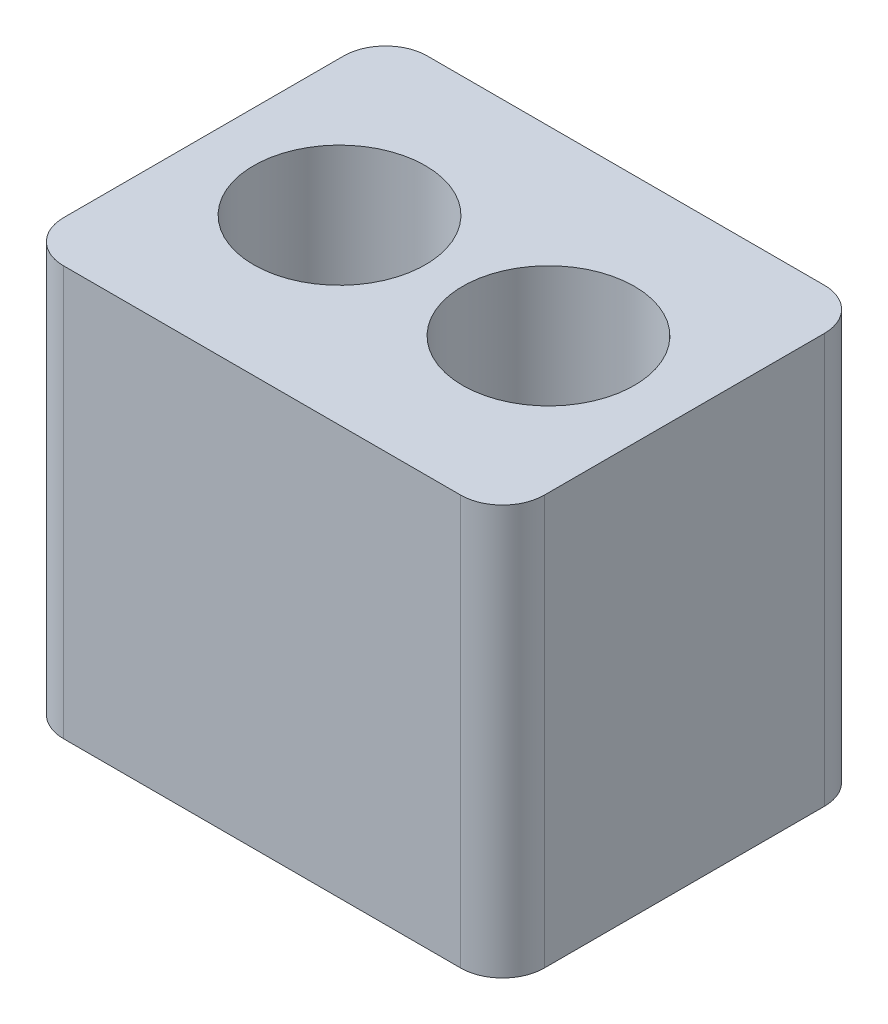
ISO-10303-21;
HEADER;
FILE_DESCRIPTION(('STEP AP214'),'2;1');
FILE_NAME('part.step','',(''),(''),'','','');
FILE_SCHEMA(('AUTOMOTIVE_DESIGN { 1 0 10303 214 1 1 1 1 }'));
ENDSEC;
DATA;
#1=APPLICATION_CONTEXT('core data for automotive mechanical design processes');
#2=APPLICATION_PROTOCOL_DEFINITION('international standard','automotive_design',2000,#1);
#3=PRODUCT_CONTEXT('',#1,'mechanical');
#4=PRODUCT('Part','Part','',(#3));
#5=PRODUCT_RELATED_PRODUCT_CATEGORY('part','',(#4));
#6=PRODUCT_DEFINITION_FORMATION('','',#4);
#7=PRODUCT_DEFINITION_CONTEXT('part definition',#1,'design');
#8=PRODUCT_DEFINITION('design','',#6,#7);
#9=PRODUCT_DEFINITION_SHAPE('','',#8);
#10=(LENGTH_UNIT() NAMED_UNIT(*) SI_UNIT(.MILLI.,.METRE.));
#11=(NAMED_UNIT(*) PLANE_ANGLE_UNIT() SI_UNIT($,.RADIAN.));
#12=(NAMED_UNIT(*) SI_UNIT($,.STERADIAN.) SOLID_ANGLE_UNIT());
#13=UNCERTAINTY_MEASURE_WITH_UNIT(LENGTH_MEASURE(1.E-05),#10,'distance_accuracy_value','');
#14=(GEOMETRIC_REPRESENTATION_CONTEXT(3) GLOBAL_UNCERTAINTY_ASSIGNED_CONTEXT((#13)) GLOBAL_UNIT_ASSIGNED_CONTEXT((#10,
#11,#12)) REPRESENTATION_CONTEXT('',''));
#15=CARTESIAN_POINT('',(0.,0.,0.));
#16=DIRECTION('',(0.,0.,1.));
#17=DIRECTION('',(1.,0.,0.));
#18=AXIS2_PLACEMENT_3D('',#15,#16,#17);
#19=CARTESIAN_POINT('',(2.667,-2.4892,-0.254));
#20=DIRECTION('',(0.,1.,0.));
#21=DIRECTION('',(0.,0.,1.));
#22=AXIS2_PLACEMENT_3D('',#19,#20,#21);
#23=CYLINDRICAL_SURFACE('',#22,0.254);
#24=CARTESIAN_POINT('',(2.667,0.,-0.254));
#25=DIRECTION('',(0.,1.,0.));
#26=DIRECTION('',(0.,0.,1.));
#27=AXIS2_PLACEMENT_3D('',#24,#25,#26);
#28=CIRCLE('',#27,0.254);
#29=CARTESIAN_POINT('',(2.667,0.,0.));
#30=VERTEX_POINT('',#29);
#31=CARTESIAN_POINT('',(2.921,0.,-0.254));
#32=VERTEX_POINT('',#31);
#33=EDGE_CURVE('E113',#30,#32,#28,.T.);
#34=ORIENTED_EDGE('',*,*,#33,.F.);
#35=DIRECTION('',(0.,1.,0.));
#36=VECTOR('',#35,1.);
#37=CARTESIAN_POINT('',(2.667,-2.4892,0.));
#38=LINE('',#37,#36);
#39=CARTESIAN_POINT('',(2.667,-2.4892,0.));
#40=VERTEX_POINT('',#39);
#41=EDGE_CURVE('E11',#40,#30,#38,.T.);
#42=ORIENTED_EDGE('',*,*,#41,.F.);
#43=CARTESIAN_POINT('',(2.667,-2.4892,-0.254));
#44=DIRECTION('',(0.,1.,0.));
#45=DIRECTION('',(0.,0.,1.));
#46=AXIS2_PLACEMENT_3D('',#43,#44,#45);
#47=CIRCLE('',#46,0.254);
#48=CARTESIAN_POINT('',(2.921,-2.4892,-0.254));
#49=VERTEX_POINT('',#48);
#50=EDGE_CURVE('E134',#40,#49,#47,.T.);
#51=ORIENTED_EDGE('',*,*,#50,.T.);
#52=DIRECTION('',(0.,1.,0.));
#53=VECTOR('',#52,1.);
#54=CARTESIAN_POINT('',(2.921,-2.4892,-0.254));
#55=LINE('',#54,#53);
#56=EDGE_CURVE('E19',#49,#32,#55,.T.);
#57=ORIENTED_EDGE('',*,*,#56,.T.);
#58=EDGE_LOOP('',(#34,#42,#51,#57));
#59=FACE_BOUND('',#58,.T.);
#60=ADVANCED_FACE('F16',(#59),#23,.T.);
#61=CARTESIAN_POINT('',(0.254000000000002,-2.4892,0.));
#62=DIRECTION('',(0.,0.,1.));
#63=DIRECTION('',(1.,0.,0.));
#64=AXIS2_PLACEMENT_3D('',#61,#62,#63);
#65=PLANE('',#64);
#66=DIRECTION('',(1.,0.,0.));
#67=VECTOR('',#66,1.);
#68=CARTESIAN_POINT('',(0.254000000000002,0.,0.));
#69=LINE('',#68,#67);
#70=CARTESIAN_POINT('',(0.254000000000002,0.,0.));
#71=VERTEX_POINT('',#70);
#72=EDGE_CURVE('E132',#71,#30,#69,.T.);
#73=ORIENTED_EDGE('',*,*,#72,.F.);
#74=DIRECTION('',(0.,1.,0.));
#75=VECTOR('',#74,1.);
#76=CARTESIAN_POINT('',(0.254000000000002,-2.4892,0.));
#77=LINE('',#76,#75);
#78=CARTESIAN_POINT('',(0.254000000000002,-2.4892,0.));
#79=VERTEX_POINT('',#78);
#80=EDGE_CURVE('E25',#79,#71,#77,.T.);
#81=ORIENTED_EDGE('',*,*,#80,.F.);
#82=DIRECTION('',(1.,0.,0.));
#83=VECTOR('',#82,1.);
#84=CARTESIAN_POINT('',(0.254000000000002,-2.4892,0.));
#85=LINE('',#84,#83);
#86=EDGE_CURVE('E103',#79,#40,#85,.T.);
#87=ORIENTED_EDGE('',*,*,#86,.T.);
#88=ORIENTED_EDGE('',*,*,#41,.T.);
#89=EDGE_LOOP('',(#73,#81,#87,#88));
#90=FACE_BOUND('',#89,.T.);
#91=ADVANCED_FACE('F146',(#90),#65,.T.);
#92=CARTESIAN_POINT('',(0.254,-2.4892,-0.254));
#93=DIRECTION('',(0.,1.,0.));
#94=DIRECTION('',(0.,0.,1.));
#95=AXIS2_PLACEMENT_3D('',#92,#93,#94);
#96=CYLINDRICAL_SURFACE('',#95,0.254);
#97=CARTESIAN_POINT('',(0.254,0.,-0.254));
#98=DIRECTION('',(0.,1.,0.));
#99=DIRECTION('',(0.,0.,-1.));
#100=AXIS2_PLACEMENT_3D('',#97,#98,#99);
#101=CIRCLE('',#100,0.254);
#102=CARTESIAN_POINT('',(0.,0.,-0.254000000000002));
#103=VERTEX_POINT('',#102);
#104=EDGE_CURVE('E90',#103,#71,#101,.T.);
#105=ORIENTED_EDGE('',*,*,#104,.F.);
#106=DIRECTION('',(0.,1.,0.));
#107=VECTOR('',#106,1.);
#108=CARTESIAN_POINT('',(0.,-2.4892,-0.254000000000002));
#109=LINE('',#108,#107);
#110=CARTESIAN_POINT('',(0.,-2.4892,-0.254000000000002));
#111=VERTEX_POINT('',#110);
#112=EDGE_CURVE('E85',#111,#103,#109,.T.);
#113=ORIENTED_EDGE('',*,*,#112,.F.);
#114=CARTESIAN_POINT('',(0.254,-2.4892,-0.254));
#115=DIRECTION('',(0.,1.,0.));
#116=DIRECTION('',(0.,0.,-1.));
#117=AXIS2_PLACEMENT_3D('',#114,#115,#116);
#118=CIRCLE('',#117,0.254);
#119=EDGE_CURVE('E88',#111,#79,#118,.T.);
#120=ORIENTED_EDGE('',*,*,#119,.T.);
#121=ORIENTED_EDGE('',*,*,#80,.T.);
#122=EDGE_LOOP('',(#105,#113,#120,#121));
#123=FACE_BOUND('',#122,.T.);
#124=ADVANCED_FACE('F87',(#123),#96,.T.);
#125=CARTESIAN_POINT('',(0.,-2.4892,-1.9558));
#126=DIRECTION('',(-1.,0.,0.));
#127=DIRECTION('',(0.,0.,1.));
#128=AXIS2_PLACEMENT_3D('',#125,#126,#127);
#129=PLANE('',#128);
#130=DIRECTION('',(0.,0.,1.));
#131=VECTOR('',#130,1.);
#132=CARTESIAN_POINT('',(0.,0.,-1.9558));
#133=LINE('',#132,#131);
#134=CARTESIAN_POINT('',(0.,0.,-1.9558));
#135=VERTEX_POINT('',#134);
#136=EDGE_CURVE('E129',#135,#103,#133,.T.);
#137=ORIENTED_EDGE('',*,*,#136,.F.);
#138=DIRECTION('',(0.,1.,0.));
#139=VECTOR('',#138,1.);
#140=CARTESIAN_POINT('',(0.,-2.4892,-1.9558));
#141=LINE('',#140,#139);
#142=CARTESIAN_POINT('',(0.,-2.4892,-1.9558));
#143=VERTEX_POINT('',#142);
#144=EDGE_CURVE('E95',#143,#135,#141,.T.);
#145=ORIENTED_EDGE('',*,*,#144,.F.);
#146=DIRECTION('',(0.,0.,1.));
#147=VECTOR('',#146,1.);
#148=CARTESIAN_POINT('',(0.,-2.4892,-1.9558));
#149=LINE('',#148,#147);
#150=EDGE_CURVE('E101',#143,#111,#149,.T.);
#151=ORIENTED_EDGE('',*,*,#150,.T.);
#152=ORIENTED_EDGE('',*,*,#112,.T.);
#153=EDGE_LOOP('',(#137,#145,#151,#152));
#154=FACE_BOUND('',#153,.T.);
#155=ADVANCED_FACE('F105',(#154),#129,.T.);
#156=CARTESIAN_POINT('',(0.253999999999999,-2.4892,-1.9558));
#157=DIRECTION('',(0.,1.,0.));
#158=DIRECTION('',(0.,0.,1.));
#159=AXIS2_PLACEMENT_3D('',#156,#157,#158);
#160=CYLINDRICAL_SURFACE('',#159,0.254);
#161=CARTESIAN_POINT('',(0.253999999999999,0.,-1.9558));
#162=DIRECTION('',(0.,1.,0.));
#163=DIRECTION('',(0.,0.,1.));
#164=AXIS2_PLACEMENT_3D('',#161,#162,#163);
#165=CIRCLE('',#164,0.254);
#166=CARTESIAN_POINT('',(0.254000000000001,0.,-2.2098));
#167=VERTEX_POINT('',#166);
#168=EDGE_CURVE('E126',#167,#135,#165,.T.);
#169=ORIENTED_EDGE('',*,*,#168,.F.);
#170=DIRECTION('',(0.,1.,0.));
#171=VECTOR('',#170,1.);
#172=CARTESIAN_POINT('',(0.254000000000001,-2.4892,-2.2098));
#173=LINE('',#172,#171);
#174=CARTESIAN_POINT('',(0.254000000000001,-2.4892,-2.2098));
#175=VERTEX_POINT('',#174);
#176=EDGE_CURVE('E138',#175,#167,#173,.T.);
#177=ORIENTED_EDGE('',*,*,#176,.F.);
#178=CARTESIAN_POINT('',(0.253999999999999,-2.4892,-1.9558));
#179=DIRECTION('',(0.,1.,0.));
#180=DIRECTION('',(0.,0.,1.));
#181=AXIS2_PLACEMENT_3D('',#178,#179,#180);
#182=CIRCLE('',#181,0.254);
#183=EDGE_CURVE('E106',#175,#143,#182,.T.);
#184=ORIENTED_EDGE('',*,*,#183,.T.);
#185=ORIENTED_EDGE('',*,*,#144,.T.);
#186=EDGE_LOOP('',(#169,#177,#184,#185));
#187=FACE_BOUND('',#186,.T.);
#188=ADVANCED_FACE('F160',(#187),#160,.T.);
#189=CARTESIAN_POINT('',(2.667,-2.4892,-2.2098));
#190=DIRECTION('',(0.,0.,-1.));
#191=DIRECTION('',(-1.,0.,0.));
#192=AXIS2_PLACEMENT_3D('',#189,#190,#191);
#193=PLANE('',#192);
#194=DIRECTION('',(-1.,0.,0.));
#195=VECTOR('',#194,1.);
#196=CARTESIAN_POINT('',(2.667,0.,-2.2098));
#197=LINE('',#196,#195);
#198=CARTESIAN_POINT('',(2.667,0.,-2.2098));
#199=VERTEX_POINT('',#198);
#200=EDGE_CURVE('E123',#199,#167,#197,.T.);
#201=ORIENTED_EDGE('',*,*,#200,.F.);
#202=DIRECTION('',(0.,1.,0.));
#203=VECTOR('',#202,1.);
#204=CARTESIAN_POINT('',(2.667,-2.4892,-2.2098));
#205=LINE('',#204,#203);
#206=CARTESIAN_POINT('',(2.667,-2.4892,-2.2098));
#207=VERTEX_POINT('',#206);
#208=EDGE_CURVE('E140',#207,#199,#205,.T.);
#209=ORIENTED_EDGE('',*,*,#208,.F.);
#210=DIRECTION('',(-1.,0.,0.));
#211=VECTOR('',#210,1.);
#212=CARTESIAN_POINT('',(2.667,-2.4892,-2.2098));
#213=LINE('',#212,#211);
#214=EDGE_CURVE('E108',#207,#175,#213,.T.);
#215=ORIENTED_EDGE('',*,*,#214,.T.);
#216=ORIENTED_EDGE('',*,*,#176,.T.);
#217=EDGE_LOOP('',(#201,#209,#215,#216));
#218=FACE_BOUND('',#217,.T.);
#219=ADVANCED_FACE('F163',(#218),#193,.T.);
#220=CARTESIAN_POINT('',(2.667,-2.4892,-1.9558));
#221=DIRECTION('',(0.,1.,0.));
#222=DIRECTION('',(0.,0.,1.));
#223=AXIS2_PLACEMENT_3D('',#220,#221,#222);
#224=CYLINDRICAL_SURFACE('',#223,0.254);
#225=CARTESIAN_POINT('',(2.667,0.,-1.9558));
#226=DIRECTION('',(0.,1.,0.));
#227=DIRECTION('',(0.,0.,1.));
#228=AXIS2_PLACEMENT_3D('',#225,#226,#227);
#229=CIRCLE('',#228,0.254);
#230=CARTESIAN_POINT('',(2.921,0.,-1.9558));
#231=VERTEX_POINT('',#230);
#232=EDGE_CURVE('E120',#231,#199,#229,.T.);
#233=ORIENTED_EDGE('',*,*,#232,.F.);
#234=DIRECTION('',(0.,1.,0.));
#235=VECTOR('',#234,1.);
#236=CARTESIAN_POINT('',(2.921,-2.4892,-1.9558));
#237=LINE('',#236,#235);
#238=CARTESIAN_POINT('',(2.921,-2.4892,-1.9558));
#239=VERTEX_POINT('',#238);
#240=EDGE_CURVE('E141',#239,#231,#237,.T.);
#241=ORIENTED_EDGE('',*,*,#240,.F.);
#242=CARTESIAN_POINT('',(2.667,-2.4892,-1.9558));
#243=DIRECTION('',(0.,1.,0.));
#244=DIRECTION('',(0.,0.,1.));
#245=AXIS2_PLACEMENT_3D('',#242,#243,#244);
#246=CIRCLE('',#245,0.254);
#247=EDGE_CURVE('E209',#239,#207,#246,.T.);
#248=ORIENTED_EDGE('',*,*,#247,.T.);
#249=ORIENTED_EDGE('',*,*,#208,.T.);
#250=EDGE_LOOP('',(#233,#241,#248,#249));
#251=FACE_BOUND('',#250,.T.);
#252=ADVANCED_FACE('F167',(#251),#224,.T.);
#253=CARTESIAN_POINT('',(2.921,-2.4892,-0.254));
#254=DIRECTION('',(1.,0.,0.));
#255=DIRECTION('',(0.,0.,-1.));
#256=AXIS2_PLACEMENT_3D('',#253,#254,#255);
#257=PLANE('',#256);
#258=DIRECTION('',(0.,0.,-1.));
#259=VECTOR('',#258,1.);
#260=CARTESIAN_POINT('',(2.921,0.,-0.254));
#261=LINE('',#260,#259);
#262=EDGE_CURVE('E116',#32,#231,#261,.T.);
#263=ORIENTED_EDGE('',*,*,#262,.F.);
#264=ORIENTED_EDGE('',*,*,#56,.F.);
#265=DIRECTION('',(0.,0.,-1.));
#266=VECTOR('',#265,1.);
#267=CARTESIAN_POINT('',(2.921,-2.4892,-0.254));
#268=LINE('',#267,#266);
#269=EDGE_CURVE('E207',#49,#239,#268,.T.);
#270=ORIENTED_EDGE('',*,*,#269,.T.);
#271=ORIENTED_EDGE('',*,*,#240,.T.);
#272=EDGE_LOOP('',(#263,#264,#270,#271));
#273=FACE_BOUND('',#272,.T.);
#274=ADVANCED_FACE('F143',(#273),#257,.T.);
#275=CARTESIAN_POINT('',(2.667,-2.4892,-0.254));
#276=DIRECTION('',(0.,1.,0.));
#277=DIRECTION('',(0.,0.,1.));
#278=AXIS2_PLACEMENT_3D('',#275,#276,#277);
#279=PLANE('',#278);
#280=CARTESIAN_POINT('',(2.0955,-2.4892,-1.1049));
#281=DIRECTION('',(0.,1.,0.));
#282=DIRECTION('',(0.,0.,1.));
#283=AXIS2_PLACEMENT_3D('',#280,#281,#282);
#284=CIRCLE('',#283,0.521970000000014);
#285=CARTESIAN_POINT('',(2.0955,-2.4892,-0.582929999999986));
#286=VERTEX_POINT('',#285);
#287=EDGE_CURVE('E194',#286,#286,#284,.T.);
#288=ORIENTED_EDGE('',*,*,#287,.T.);
#289=EDGE_LOOP('',(#288));
#290=FACE_BOUND('',#289,.T.);
#291=CARTESIAN_POINT('',(0.825499999999999,-2.4892,-1.1049));
#292=DIRECTION('',(0.,1.,0.));
#293=DIRECTION('',(0.,0.,1.));
#294=AXIS2_PLACEMENT_3D('',#291,#292,#293);
#295=CIRCLE('',#294,0.521970000000014);
#296=CARTESIAN_POINT('',(0.825499999999999,-2.4892,-0.582929999999986));
#297=VERTEX_POINT('',#296);
#298=EDGE_CURVE('E117',#297,#297,#295,.T.);
#299=ORIENTED_EDGE('',*,*,#298,.T.);
#300=EDGE_LOOP('',(#299));
#301=FACE_BOUND('',#300,.T.);
#302=ORIENTED_EDGE('',*,*,#50,.F.);
#303=ORIENTED_EDGE('',*,*,#86,.F.);
#304=ORIENTED_EDGE('',*,*,#119,.F.);
#305=ORIENTED_EDGE('',*,*,#150,.F.);
#306=ORIENTED_EDGE('',*,*,#183,.F.);
#307=ORIENTED_EDGE('',*,*,#214,.F.);
#308=ORIENTED_EDGE('',*,*,#247,.F.);
#309=ORIENTED_EDGE('',*,*,#269,.F.);
#310=EDGE_LOOP('',(#302,#303,#304,#305,#306,#307,#308,#309));
#311=FACE_BOUND('',#310,.T.);
#312=ADVANCED_FACE('F99',(#290,#301,#311),#279,.F.);
#313=CARTESIAN_POINT('',(2.667,0.,-0.254));
#314=DIRECTION('',(0.,1.,0.));
#315=DIRECTION('',(0.,0.,1.));
#316=AXIS2_PLACEMENT_3D('',#313,#314,#315);
#317=PLANE('',#316);
#318=CARTESIAN_POINT('',(2.0955,0.,-1.1049));
#319=DIRECTION('',(0.,1.,0.));
#320=DIRECTION('',(0.,0.,1.));
#321=AXIS2_PLACEMENT_3D('',#318,#319,#320);
#322=CIRCLE('',#321,0.521970000000014);
#323=CARTESIAN_POINT('',(2.0955,0.,-0.582929999999986));
#324=VERTEX_POINT('',#323);
#325=EDGE_CURVE('E197',#324,#324,#322,.T.);
#326=ORIENTED_EDGE('',*,*,#325,.F.);
#327=EDGE_LOOP('',(#326));
#328=FACE_BOUND('',#327,.T.);
#329=CARTESIAN_POINT('',(0.825499999999999,0.,-1.1049));
#330=DIRECTION('',(0.,1.,0.));
#331=DIRECTION('',(0.,0.,1.));
#332=AXIS2_PLACEMENT_3D('',#329,#330,#331);
#333=CIRCLE('',#332,0.521970000000014);
#334=CARTESIAN_POINT('',(0.825499999999999,0.,-0.582929999999986));
#335=VERTEX_POINT('',#334);
#336=EDGE_CURVE('E198',#335,#335,#333,.T.);
#337=ORIENTED_EDGE('',*,*,#336,.F.);
#338=EDGE_LOOP('',(#337));
#339=FACE_BOUND('',#338,.T.);
#340=ORIENTED_EDGE('',*,*,#33,.T.);
#341=ORIENTED_EDGE('',*,*,#262,.T.);
#342=ORIENTED_EDGE('',*,*,#232,.T.);
#343=ORIENTED_EDGE('',*,*,#200,.T.);
#344=ORIENTED_EDGE('',*,*,#168,.T.);
#345=ORIENTED_EDGE('',*,*,#136,.T.);
#346=ORIENTED_EDGE('',*,*,#104,.T.);
#347=ORIENTED_EDGE('',*,*,#72,.T.);
#348=EDGE_LOOP('',(#340,#341,#342,#343,#344,#345,#346,#347));
#349=FACE_BOUND('',#348,.T.);
#350=ADVANCED_FACE('F145',(#328,#339,#349),#317,.T.);
#351=CARTESIAN_POINT('',(0.825499999999999,0.,-1.1049));
#352=DIRECTION('',(0.,1.,0.));
#353=DIRECTION('',(0.,0.,1.));
#354=AXIS2_PLACEMENT_3D('',#351,#352,#353);
#355=CYLINDRICAL_SURFACE('',#354,0.521970000000014);
#356=ORIENTED_EDGE('',*,*,#298,.F.);
#357=EDGE_LOOP('',(#356));
#358=FACE_BOUND('',#357,.T.);
#359=ORIENTED_EDGE('',*,*,#336,.T.);
#360=EDGE_LOOP('',(#359));
#361=FACE_BOUND('',#360,.T.);
#362=ADVANCED_FACE('F179',(#358,#361),#355,.F.);
#363=CARTESIAN_POINT('',(2.0955,0.,-1.1049));
#364=DIRECTION('',(0.,1.,0.));
#365=DIRECTION('',(0.,0.,1.));
#366=AXIS2_PLACEMENT_3D('',#363,#364,#365);
#367=CYLINDRICAL_SURFACE('',#366,0.521970000000014);
#368=ORIENTED_EDGE('',*,*,#287,.F.);
#369=EDGE_LOOP('',(#368));
#370=FACE_BOUND('',#369,.T.);
#371=ORIENTED_EDGE('',*,*,#325,.T.);
#372=EDGE_LOOP('',(#371));
#373=FACE_BOUND('',#372,.T.);
#374=ADVANCED_FACE('F186',(#370,#373),#367,.F.);
#375=CLOSED_SHELL('',(#60,#91,#124,#155,#188,#219,#252,#274,#312,#350,#362,#374));
#376=MANIFOLD_SOLID_BREP('B1',#375);
#377=ADVANCED_BREP_SHAPE_REPRESENTATION('',(#18,#376),#14);
#378=SHAPE_DEFINITION_REPRESENTATION(#9,#377);
ENDSEC;
END-ISO-10303-21;
